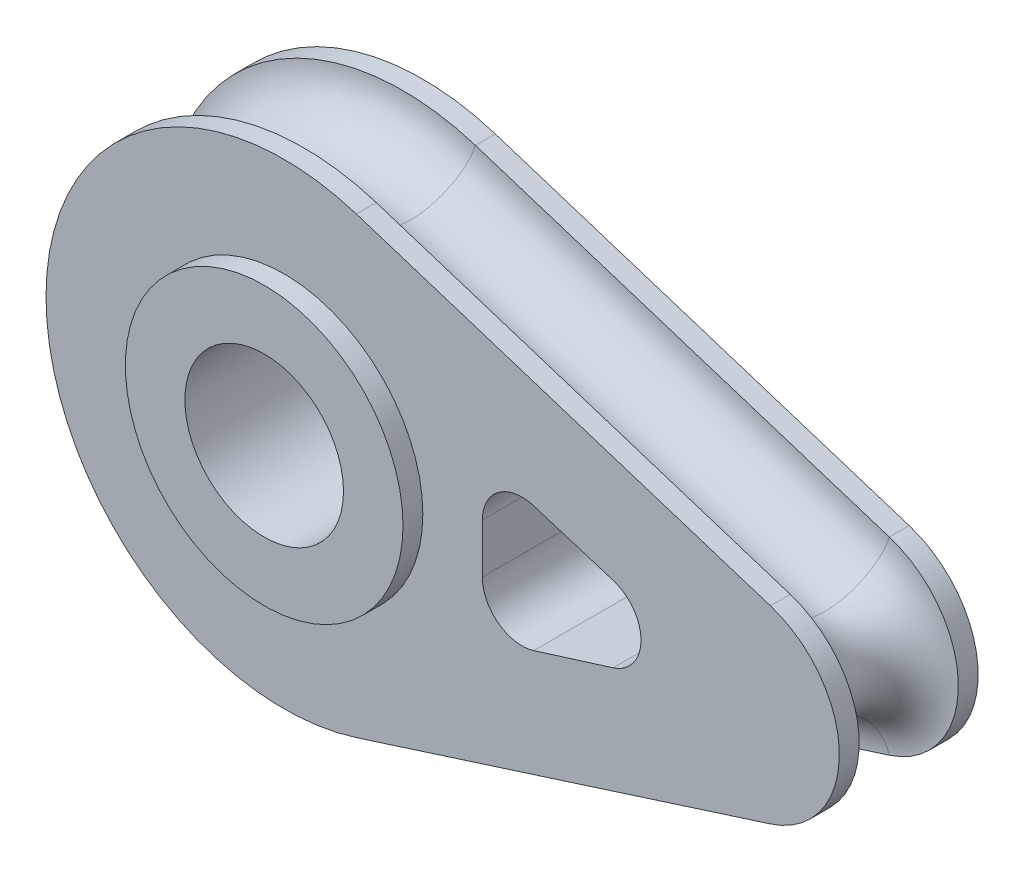
ISO-10303-21;
HEADER;
FILE_DESCRIPTION(('STEP AP214'),'2;1');
FILE_NAME('part.step','',(''),(''),'','','');
FILE_SCHEMA(('AUTOMOTIVE_DESIGN { 1 0 10303 214 1 1 1 1 }'));
ENDSEC;
DATA;
#1=APPLICATION_CONTEXT('core data for automotive mechanical design processes');
#2=APPLICATION_PROTOCOL_DEFINITION('international standard','automotive_design',2000,#1);
#3=PRODUCT_CONTEXT('',#1,'mechanical');
#4=PRODUCT('Part','Part','',(#3));
#5=PRODUCT_RELATED_PRODUCT_CATEGORY('part','',(#4));
#6=PRODUCT_DEFINITION_FORMATION('','',#4);
#7=PRODUCT_DEFINITION_CONTEXT('part definition',#1,'design');
#8=PRODUCT_DEFINITION('design','',#6,#7);
#9=PRODUCT_DEFINITION_SHAPE('','',#8);
#10=(LENGTH_UNIT() NAMED_UNIT(*) SI_UNIT(.MILLI.,.METRE.));
#11=(NAMED_UNIT(*) PLANE_ANGLE_UNIT() SI_UNIT($,.RADIAN.));
#12=(NAMED_UNIT(*) SI_UNIT($,.STERADIAN.) SOLID_ANGLE_UNIT());
#13=UNCERTAINTY_MEASURE_WITH_UNIT(LENGTH_MEASURE(1.E-05),#10,'distance_accuracy_value','');
#14=(GEOMETRIC_REPRESENTATION_CONTEXT(3) GLOBAL_UNCERTAINTY_ASSIGNED_CONTEXT((#13)) GLOBAL_UNIT_ASSIGNED_CONTEXT((#10,
#11,#12)) REPRESENTATION_CONTEXT('',''));
#15=CARTESIAN_POINT('',(0.,0.,0.));
#16=DIRECTION('',(0.,0.,1.));
#17=DIRECTION('',(1.,0.,0.));
#18=AXIS2_PLACEMENT_3D('',#15,#16,#17);
#19=CARTESIAN_POINT('',(-311.426086956522,-60.4876215679618,44.45));
#20=DIRECTION('',(0.,0.,-1.));
#21=DIRECTION('',(-1.,0.,0.));
#22=AXIS2_PLACEMENT_3D('',#19,#20,#21);
#23=CYLINDRICAL_SURFACE('',#22,152.4);
#24=CARTESIAN_POINT('',(-311.426086956522,-60.4876215679618,-31.75));
#25=DIRECTION('',(0.,0.,1.));
#26=DIRECTION('',(1.,0.,0.));
#27=AXIS2_PLACEMENT_3D('',#24,#25,#26);
#28=CIRCLE('',#27,152.4);
#29=CARTESIAN_POINT('',(-265.043478260869,84.6826701951464,-31.75));
#30=VERTEX_POINT('',#29);
#31=CARTESIAN_POINT('',(-265.043478260869,-205.65791333107,-31.75));
#32=VERTEX_POINT('',#31);
#33=EDGE_CURVE('E196',#30,#32,#28,.T.);
#34=ORIENTED_EDGE('',*,*,#33,.F.);
#35=DIRECTION('',(0.,0.,-1.));
#36=VECTOR('',#35,1.);
#37=CARTESIAN_POINT('',(-265.04347826087,84.6826701951466,44.45));
#38=LINE('',#37,#36);
#39=CARTESIAN_POINT('',(-265.04347826087,84.6826701951466,-44.45));
#40=VERTEX_POINT('',#39);
#41=EDGE_CURVE('E177',#30,#40,#38,.T.);
#42=ORIENTED_EDGE('',*,*,#41,.T.);
#43=CARTESIAN_POINT('',(-311.426086956522,-60.4876215679618,-44.45));
#44=DIRECTION('',(0.,0.,1.));
#45=DIRECTION('',(1.,0.,0.));
#46=AXIS2_PLACEMENT_3D('',#43,#44,#45);
#47=CIRCLE('',#46,152.4);
#48=CARTESIAN_POINT('',(-265.04347826087,-205.65791333107,-44.45));
#49=VERTEX_POINT('',#48);
#50=EDGE_CURVE('E222',#40,#49,#47,.T.);
#51=ORIENTED_EDGE('',*,*,#50,.T.);
#52=DIRECTION('',(0.,0.,-1.));
#53=VECTOR('',#52,1.);
#54=CARTESIAN_POINT('',(-265.04347826087,-205.65791333107,44.45));
#55=LINE('',#54,#53);
#56=EDGE_CURVE('E172',#32,#49,#55,.T.);
#57=ORIENTED_EDGE('',*,*,#56,.F.);
#58=EDGE_LOOP('',(#34,#42,#51,#57));
#59=FACE_BOUND('',#58,.T.);
#60=ADVANCED_FACE('F35',(#59),#23,.T.);
#61=CARTESIAN_POINT('',(-311.426086956522,-60.4876215679618,31.75));
#62=DIRECTION('',(0.,0.,-1.));
#63=DIRECTION('',(-1.,0.,0.));
#64=AXIS2_PLACEMENT_3D('',#61,#62,#63);
#65=CIRCLE('',#64,152.4);
#66=CARTESIAN_POINT('',(-265.043478260869,-205.65791333107,31.75));
#67=VERTEX_POINT('',#66);
#68=CARTESIAN_POINT('',(-265.04347826087,84.6826701951466,31.75));
#69=VERTEX_POINT('',#68);
#70=EDGE_CURVE('E194',#67,#69,#65,.T.);
#71=ORIENTED_EDGE('',*,*,#70,.F.);
#72=CARTESIAN_POINT('',(-265.04347826087,-205.65791333107,44.45));
#73=VERTEX_POINT('',#72);
#74=EDGE_CURVE('E173',#73,#67,#55,.T.);
#75=ORIENTED_EDGE('',*,*,#74,.F.);
#76=CARTESIAN_POINT('',(-311.426086956522,-60.4876215679618,44.45));
#77=DIRECTION('',(0.,0.,1.));
#78=DIRECTION('',(1.,0.,0.));
#79=AXIS2_PLACEMENT_3D('',#76,#77,#78);
#80=CIRCLE('',#79,152.4);
#81=CARTESIAN_POINT('',(-265.04347826087,84.6826701951466,44.45));
#82=VERTEX_POINT('',#81);
#83=EDGE_CURVE('E208',#82,#73,#80,.T.);
#84=ORIENTED_EDGE('',*,*,#83,.F.);
#85=EDGE_CURVE('E167',#82,#69,#38,.T.);
#86=ORIENTED_EDGE('',*,*,#85,.T.);
#87=EDGE_LOOP('',(#71,#75,#84,#86));
#88=FACE_BOUND('',#87,.T.);
#89=ADVANCED_FACE('F200',(#88),#23,.T.);
#90=CARTESIAN_POINT('',(-265.04347826087,-205.65791333107,44.45));
#91=DIRECTION('',(-0.304347826086957,0.952560969574202,0.));
#92=DIRECTION('',(-0.952560969574202,-0.304347826086957,0.));
#93=AXIS2_PLACEMENT_3D('',#90,#91,#92);
#94=PLANE('',#93);
#95=DIRECTION('',(-0.952560969574202,-0.304347826086957,0.));
#96=VECTOR('',#95,1.);
#97=CARTESIAN_POINT('',(1.34416378522093E-13,-120.975243135924,-31.75));
#98=LINE('',#97,#96);
#99=CARTESIAN_POINT('',(1.47910542273881E-13,-120.975243135924,-31.75));
#100=VERTEX_POINT('',#99);
#101=EDGE_CURVE('E11',#32,#100,#98,.F.);
#102=ORIENTED_EDGE('',*,*,#101,.F.);
#103=ORIENTED_EDGE('',*,*,#56,.T.);
#104=DIRECTION('',(0.952560969574202,0.304347826086957,0.));
#105=VECTOR('',#104,1.);
#106=CARTESIAN_POINT('',(-265.04347826087,-205.65791333107,-44.45));
#107=LINE('',#106,#105);
#108=CARTESIAN_POINT('',(0.,-120.975243135924,-44.45));
#109=VERTEX_POINT('',#108);
#110=EDGE_CURVE('E225',#49,#109,#107,.T.);
#111=ORIENTED_EDGE('',*,*,#110,.T.);
#112=DIRECTION('',(0.,0.,-1.));
#113=VECTOR('',#112,1.);
#114=CARTESIAN_POINT('',(0.,-120.975243135924,44.45));
#115=LINE('',#114,#113);
#116=EDGE_CURVE('E163',#100,#109,#115,.T.);
#117=ORIENTED_EDGE('',*,*,#116,.F.);
#118=EDGE_LOOP('',(#102,#103,#111,#117));
#119=FACE_BOUND('',#118,.T.);
#120=ADVANCED_FACE('F354',(#119),#94,.F.);
#121=DIRECTION('',(-0.952560969574202,-0.304347826086957,0.));
#122=VECTOR('',#121,1.);
#123=CARTESIAN_POINT('',(1.34416378522093E-13,-120.975243135924,31.75));
#124=LINE('',#123,#122);
#125=CARTESIAN_POINT('',(1.47910542273881E-13,-120.975243135924,31.75));
#126=VERTEX_POINT('',#125);
#127=EDGE_CURVE('E42',#126,#67,#124,.T.);
#128=ORIENTED_EDGE('',*,*,#127,.F.);
#129=CARTESIAN_POINT('',(0.,-120.975243135924,44.45));
#130=VERTEX_POINT('',#129);
#131=EDGE_CURVE('E159',#130,#126,#115,.T.);
#132=ORIENTED_EDGE('',*,*,#131,.F.);
#133=DIRECTION('',(0.952560969574202,0.304347826086957,0.));
#134=VECTOR('',#133,1.);
#135=CARTESIAN_POINT('',(-265.04347826087,-205.65791333107,44.45));
#136=LINE('',#135,#134);
#137=EDGE_CURVE('E204',#73,#130,#136,.T.);
#138=ORIENTED_EDGE('',*,*,#137,.F.);
#139=ORIENTED_EDGE('',*,*,#74,.T.);
#140=EDGE_LOOP('',(#128,#132,#138,#139));
#141=FACE_BOUND('',#140,.T.);
#142=ADVANCED_FACE('F203',(#141),#94,.F.);
#143=CARTESIAN_POINT('',(-19.3260869565217,-60.4876215679618,44.45));
#144=DIRECTION('',(0.,0.,-1.));
#145=DIRECTION('',(-1.,0.,0.));
#146=AXIS2_PLACEMENT_3D('',#143,#144,#145);
#147=CYLINDRICAL_SURFACE('',#146,63.5);
#148=CARTESIAN_POINT('',(-19.3260869565217,-60.4876215679618,-31.75));
#149=DIRECTION('',(0.,0.,1.));
#150=DIRECTION('',(1.,0.,0.));
#151=AXIS2_PLACEMENT_3D('',#148,#149,#150);
#152=CIRCLE('',#151,63.5);
#153=CARTESIAN_POINT('',(0.,0.,-31.75));
#154=VERTEX_POINT('',#153);
#155=EDGE_CURVE('E147',#100,#154,#152,.T.);
#156=ORIENTED_EDGE('',*,*,#155,.F.);
#157=ORIENTED_EDGE('',*,*,#116,.T.);
#158=CARTESIAN_POINT('',(-19.3260869565217,-60.4876215679618,-44.45));
#159=DIRECTION('',(0.,0.,1.));
#160=DIRECTION('',(1.,0.,0.));
#161=AXIS2_PLACEMENT_3D('',#158,#159,#160);
#162=CIRCLE('',#161,63.5);
#163=CARTESIAN_POINT('',(0.,0.,-44.45));
#164=VERTEX_POINT('',#163);
#165=EDGE_CURVE('E215',#109,#164,#162,.T.);
#166=ORIENTED_EDGE('',*,*,#165,.T.);
#167=DIRECTION('',(0.,0.,-1.));
#168=VECTOR('',#167,1.);
#169=CARTESIAN_POINT('',(0.,0.,44.45));
#170=LINE('',#169,#168);
#171=EDGE_CURVE('E164',#154,#164,#170,.T.);
#172=ORIENTED_EDGE('',*,*,#171,.F.);
#173=EDGE_LOOP('',(#156,#157,#166,#172));
#174=FACE_BOUND('',#173,.T.);
#175=ADVANCED_FACE('F233',(#174),#147,.T.);
#176=CARTESIAN_POINT('',(-19.3260869565217,-60.4876215679618,31.75));
#177=DIRECTION('',(0.,0.,-1.));
#178=DIRECTION('',(-1.,0.,0.));
#179=AXIS2_PLACEMENT_3D('',#176,#177,#178);
#180=CIRCLE('',#179,63.5);
#181=CARTESIAN_POINT('',(-1.44811698864151E-13,0.,31.75));
#182=VERTEX_POINT('',#181);
#183=EDGE_CURVE('E144',#182,#126,#180,.T.);
#184=ORIENTED_EDGE('',*,*,#183,.F.);
#185=CARTESIAN_POINT('',(0.,0.,44.45));
#186=VERTEX_POINT('',#185);
#187=EDGE_CURVE('E156',#186,#182,#170,.T.);
#188=ORIENTED_EDGE('',*,*,#187,.F.);
#189=CARTESIAN_POINT('',(-19.3260869565217,-60.4876215679618,44.45));
#190=DIRECTION('',(0.,0.,1.));
#191=DIRECTION('',(1.,0.,0.));
#192=AXIS2_PLACEMENT_3D('',#189,#190,#191);
#193=CIRCLE('',#192,63.5);
#194=EDGE_CURVE('E207',#130,#186,#193,.T.);
#195=ORIENTED_EDGE('',*,*,#194,.F.);
#196=ORIENTED_EDGE('',*,*,#131,.T.);
#197=EDGE_LOOP('',(#184,#188,#195,#196));
#198=FACE_BOUND('',#197,.T.);
#199=ADVANCED_FACE('F154',(#198),#147,.T.);
#200=CARTESIAN_POINT('',(-265.04347826087,84.6826701951466,44.45));
#201=DIRECTION('',(-0.304347826086957,-0.952560969574202,0.));
#202=DIRECTION('',(0.952560969574202,-0.304347826086957,0.));
#203=AXIS2_PLACEMENT_3D('',#200,#201,#202);
#204=PLANE('',#203);
#205=ORIENTED_EDGE('',*,*,#187,.T.);
#206=DIRECTION('',(-0.952560969574202,0.304347826086957,0.));
#207=VECTOR('',#206,1.);
#208=CARTESIAN_POINT('',(-1.44811698864151E-13,0.,31.75));
#209=LINE('',#208,#207);
#210=EDGE_CURVE('E132',#182,#69,#209,.T.);
#211=ORIENTED_EDGE('',*,*,#210,.T.);
#212=ORIENTED_EDGE('',*,*,#85,.F.);
#213=DIRECTION('',(-0.952560969574202,0.304347826086957,0.));
#214=VECTOR('',#213,1.);
#215=CARTESIAN_POINT('',(-265.04347826087,84.6826701951466,44.45));
#216=LINE('',#215,#214);
#217=EDGE_CURVE('E162',#186,#82,#216,.T.);
#218=ORIENTED_EDGE('',*,*,#217,.F.);
#219=EDGE_LOOP('',(#205,#211,#212,#218));
#220=FACE_BOUND('',#219,.T.);
#221=ADVANCED_FACE('F161',(#220),#204,.F.);
#222=CARTESIAN_POINT('',(-311.426086956522,-60.4876215679618,44.45));
#223=DIRECTION('',(0.,0.,1.));
#224=DIRECTION('',(1.,0.,0.));
#225=AXIS2_PLACEMENT_3D('',#222,#223,#224);
#226=PLANE('',#225);
#227=ORIENTED_EDGE('',*,*,#83,.T.);
#228=ORIENTED_EDGE('',*,*,#137,.T.);
#229=ORIENTED_EDGE('',*,*,#194,.T.);
#230=ORIENTED_EDGE('',*,*,#217,.T.);
#231=EDGE_LOOP('',(#227,#228,#229,#230));
#232=FACE_BOUND('',#231,.T.);
#233=DIRECTION('',(0.95447997803503,0.298274993135947,0.));
#234=VECTOR('',#233,1.);
#235=CARTESIAN_POINT('',(-151.449902130869,-100.606413010052,44.45));
#236=LINE('',#235,#234);
#237=CARTESIAN_POINT('',(-151.449902130869,-100.606413010052,44.45));
#238=VERTEX_POINT('',#237);
#239=CARTESIAN_POINT('',(-100.649902130869,-84.7314130100516,44.45));
#240=VERTEX_POINT('',#239);
#241=EDGE_CURVE('E275',#238,#240,#236,.T.);
#242=ORIENTED_EDGE('',*,*,#241,.F.);
#243=CARTESIAN_POINT('',(-159.026086956522,-76.3626215679618,44.45));
#244=DIRECTION('',(0.,0.,1.));
#245=DIRECTION('',(1.,0.,0.));
#246=AXIS2_PLACEMENT_3D('',#243,#244,#245);
#247=CIRCLE('',#246,25.4);
#248=CARTESIAN_POINT('',(-184.426086956522,-76.3626215679618,44.45));
#249=VERTEX_POINT('',#248);
#250=EDGE_CURVE('E273',#249,#238,#247,.T.);
#251=ORIENTED_EDGE('',*,*,#250,.F.);
#252=DIRECTION('',(0.,-1.,0.));
#253=VECTOR('',#252,1.);
#254=CARTESIAN_POINT('',(-184.426086956522,-44.6126215679619,44.45));
#255=LINE('',#254,#253);
#256=CARTESIAN_POINT('',(-184.426086956522,-44.6126215679619,44.45));
#257=VERTEX_POINT('',#256);
#258=EDGE_CURVE('E285',#257,#249,#255,.T.);
#259=ORIENTED_EDGE('',*,*,#258,.F.);
#260=CARTESIAN_POINT('',(-159.026086956522,-44.6126215679618,44.45));
#261=DIRECTION('',(0.,0.,1.));
#262=DIRECTION('',(1.,0.,0.));
#263=AXIS2_PLACEMENT_3D('',#260,#261,#262);
#264=CIRCLE('',#263,25.4);
#265=CARTESIAN_POINT('',(-151.449902130869,-20.3688301258721,44.45));
#266=VERTEX_POINT('',#265);
#267=EDGE_CURVE('E282',#266,#257,#264,.T.);
#268=ORIENTED_EDGE('',*,*,#267,.F.);
#269=DIRECTION('',(-0.95447997803503,0.298274993135946,0.));
#270=VECTOR('',#269,1.);
#271=CARTESIAN_POINT('',(-151.449902130869,-20.3688301258721,44.45));
#272=LINE('',#271,#270);
#273=CARTESIAN_POINT('',(-100.649902130869,-36.2438301258721,44.45));
#274=VERTEX_POINT('',#273);
#275=EDGE_CURVE('E280',#274,#266,#272,.T.);
#276=ORIENTED_EDGE('',*,*,#275,.F.);
#277=CARTESIAN_POINT('',(-108.226086956522,-60.4876215679618,44.45));
#278=DIRECTION('',(0.,0.,1.));
#279=DIRECTION('',(1.,0.,0.));
#280=AXIS2_PLACEMENT_3D('',#277,#278,#279);
#281=CIRCLE('',#280,25.4);
#282=EDGE_CURVE('E278',#240,#274,#281,.T.);
#283=ORIENTED_EDGE('',*,*,#282,.F.);
#284=EDGE_LOOP('',(#242,#251,#259,#268,#276,#283));
#285=FACE_BOUND('',#284,.T.);
#286=CARTESIAN_POINT('',(-311.426086956522,-60.4876215679618,44.45));
#287=DIRECTION('',(0.,0.,1.));
#288=DIRECTION('',(1.,0.,0.));
#289=AXIS2_PLACEMENT_3D('',#286,#287,#288);
#290=CIRCLE('',#289,88.9);
#291=CARTESIAN_POINT('',(-222.526086956522,-60.4876215679618,44.45));
#292=VERTEX_POINT('',#291);
#293=EDGE_CURVE('E266',#292,#292,#290,.T.);
#294=ORIENTED_EDGE('',*,*,#293,.F.);
#295=EDGE_LOOP('',(#294));
#296=FACE_BOUND('',#295,.T.);
#297=ADVANCED_FACE('F210',(#232,#285,#296),#226,.T.);
#298=CARTESIAN_POINT('',(-311.426086956522,-60.4876215679618,-44.45));
#299=DIRECTION('',(0.,0.,1.));
#300=DIRECTION('',(1.,0.,0.));
#301=AXIS2_PLACEMENT_3D('',#298,#299,#300);
#302=PLANE('',#301);
#303=CARTESIAN_POINT('',(-311.426086956522,-60.4876215679618,-44.45));
#304=DIRECTION('',(0.,0.,1.));
#305=DIRECTION('',(1.,0.,0.));
#306=AXIS2_PLACEMENT_3D('',#303,#304,#305);
#307=CIRCLE('',#306,88.9);
#308=CARTESIAN_POINT('',(-222.526086956522,-60.4876215679618,-44.45));
#309=VERTEX_POINT('',#308);
#310=EDGE_CURVE('E251',#309,#309,#307,.T.);
#311=ORIENTED_EDGE('',*,*,#310,.T.);
#312=EDGE_LOOP('',(#311));
#313=FACE_BOUND('',#312,.T.);
#314=ORIENTED_EDGE('',*,*,#50,.F.);
#315=DIRECTION('',(-0.952560969574202,0.304347826086957,0.));
#316=VECTOR('',#315,1.);
#317=CARTESIAN_POINT('',(-265.04347826087,84.6826701951466,-44.45));
#318=LINE('',#317,#316);
#319=EDGE_CURVE('E212',#164,#40,#318,.T.);
#320=ORIENTED_EDGE('',*,*,#319,.F.);
#321=ORIENTED_EDGE('',*,*,#165,.F.);
#322=ORIENTED_EDGE('',*,*,#110,.F.);
#323=EDGE_LOOP('',(#314,#320,#321,#322));
#324=FACE_BOUND('',#323,.T.);
#325=CARTESIAN_POINT('',(-159.026086956522,-76.3626215679618,-44.45));
#326=DIRECTION('',(0.,0.,1.));
#327=DIRECTION('',(1.,0.,0.));
#328=AXIS2_PLACEMENT_3D('',#325,#326,#327);
#329=CIRCLE('',#328,25.4);
#330=CARTESIAN_POINT('',(-184.426086956522,-76.3626215679618,-44.45));
#331=VERTEX_POINT('',#330);
#332=CARTESIAN_POINT('',(-151.449902130869,-100.606413010052,-44.45));
#333=VERTEX_POINT('',#332);
#334=EDGE_CURVE('E270',#331,#333,#329,.T.);
#335=ORIENTED_EDGE('',*,*,#334,.T.);
#336=DIRECTION('',(0.95447997803503,0.298274993135947,0.));
#337=VECTOR('',#336,1.);
#338=CARTESIAN_POINT('',(-151.449902130869,-100.606413010052,-44.45));
#339=LINE('',#338,#337);
#340=CARTESIAN_POINT('',(-100.649902130869,-84.7314130100516,-44.45));
#341=VERTEX_POINT('',#340);
#342=EDGE_CURVE('E290',#333,#341,#339,.T.);
#343=ORIENTED_EDGE('',*,*,#342,.T.);
#344=CARTESIAN_POINT('',(-108.226086956522,-60.4876215679618,-44.45));
#345=DIRECTION('',(0.,0.,1.));
#346=DIRECTION('',(1.,0.,0.));
#347=AXIS2_PLACEMENT_3D('',#344,#345,#346);
#348=CIRCLE('',#347,25.4);
#349=CARTESIAN_POINT('',(-100.649902130869,-36.2438301258721,-44.45));
#350=VERTEX_POINT('',#349);
#351=EDGE_CURVE('E293',#341,#350,#348,.T.);
#352=ORIENTED_EDGE('',*,*,#351,.T.);
#353=DIRECTION('',(-0.95447997803503,0.298274993135946,0.));
#354=VECTOR('',#353,1.);
#355=CARTESIAN_POINT('',(-151.449902130869,-20.3688301258721,-44.45));
#356=LINE('',#355,#354);
#357=CARTESIAN_POINT('',(-151.449902130869,-20.3688301258721,-44.45));
#358=VERTEX_POINT('',#357);
#359=EDGE_CURVE('E296',#350,#358,#356,.T.);
#360=ORIENTED_EDGE('',*,*,#359,.T.);
#361=CARTESIAN_POINT('',(-159.026086956522,-44.6126215679618,-44.45));
#362=DIRECTION('',(0.,0.,1.));
#363=DIRECTION('',(1.,0.,0.));
#364=AXIS2_PLACEMENT_3D('',#361,#362,#363);
#365=CIRCLE('',#364,25.4);
#366=CARTESIAN_POINT('',(-184.426086956522,-44.6126215679619,-44.45));
#367=VERTEX_POINT('',#366);
#368=EDGE_CURVE('E299',#358,#367,#365,.T.);
#369=ORIENTED_EDGE('',*,*,#368,.T.);
#370=DIRECTION('',(0.,-1.,0.));
#371=VECTOR('',#370,1.);
#372=CARTESIAN_POINT('',(-184.426086956522,-44.6126215679619,-44.45));
#373=LINE('',#372,#371);
#374=EDGE_CURVE('E276',#367,#331,#373,.T.);
#375=ORIENTED_EDGE('',*,*,#374,.T.);
#376=EDGE_LOOP('',(#335,#343,#352,#360,#369,#375));
#377=FACE_BOUND('',#376,.T.);
#378=ADVANCED_FACE('F238',(#313,#324,#377),#302,.F.);
#379=ORIENTED_EDGE('',*,*,#41,.F.);
#380=DIRECTION('',(-0.952560969574202,0.304347826086957,0.));
#381=VECTOR('',#380,1.);
#382=CARTESIAN_POINT('',(-1.44811698864151E-13,0.,-31.75));
#383=LINE('',#382,#381);
#384=EDGE_CURVE('E138',#30,#154,#383,.F.);
#385=ORIENTED_EDGE('',*,*,#384,.T.);
#386=ORIENTED_EDGE('',*,*,#171,.T.);
#387=ORIENTED_EDGE('',*,*,#319,.T.);
#388=EDGE_LOOP('',(#379,#385,#386,#387));
#389=FACE_BOUND('',#388,.T.);
#390=ADVANCED_FACE('F242',(#389),#204,.F.);
#391=CARTESIAN_POINT('',(-159.026086956522,-76.3626215679618,44.45));
#392=DIRECTION('',(0.,0.,-1.));
#393=DIRECTION('',(-1.,0.,0.));
#394=AXIS2_PLACEMENT_3D('',#391,#392,#393);
#395=CYLINDRICAL_SURFACE('',#394,25.4);
#396=ORIENTED_EDGE('',*,*,#334,.F.);
#397=DIRECTION('',(0.,0.,-1.));
#398=VECTOR('',#397,1.);
#399=CARTESIAN_POINT('',(-184.426086956522,-76.3626215679618,44.45));
#400=LINE('',#399,#398);
#401=EDGE_CURVE('E287',#249,#331,#400,.T.);
#402=ORIENTED_EDGE('',*,*,#401,.F.);
#403=ORIENTED_EDGE('',*,*,#250,.T.);
#404=DIRECTION('',(0.,0.,-1.));
#405=VECTOR('',#404,1.);
#406=CARTESIAN_POINT('',(-151.449902130869,-100.606413010052,44.45));
#407=LINE('',#406,#405);
#408=EDGE_CURVE('E217',#238,#333,#407,.T.);
#409=ORIENTED_EDGE('',*,*,#408,.T.);
#410=EDGE_LOOP('',(#396,#402,#403,#409));
#411=FACE_BOUND('',#410,.T.);
#412=ADVANCED_FACE('F318',(#411),#395,.F.);
#413=CARTESIAN_POINT('',(-151.449902130869,-100.606413010052,44.45));
#414=DIRECTION('',(-0.298274993135947,0.95447997803503,0.));
#415=DIRECTION('',(-0.95447997803503,-0.298274993135947,0.));
#416=AXIS2_PLACEMENT_3D('',#413,#414,#415);
#417=PLANE('',#416);
#418=ORIENTED_EDGE('',*,*,#342,.F.);
#419=ORIENTED_EDGE('',*,*,#408,.F.);
#420=ORIENTED_EDGE('',*,*,#241,.T.);
#421=DIRECTION('',(0.,0.,-1.));
#422=VECTOR('',#421,1.);
#423=CARTESIAN_POINT('',(-100.649902130869,-84.7314130100516,44.45));
#424=LINE('',#423,#422);
#425=EDGE_CURVE('E311',#240,#341,#424,.T.);
#426=ORIENTED_EDGE('',*,*,#425,.T.);
#427=EDGE_LOOP('',(#418,#419,#420,#426));
#428=FACE_BOUND('',#427,.T.);
#429=ADVANCED_FACE('F331',(#428),#417,.T.);
#430=CARTESIAN_POINT('',(-108.226086956522,-60.4876215679618,44.45));
#431=DIRECTION('',(0.,0.,-1.));
#432=DIRECTION('',(-1.,0.,0.));
#433=AXIS2_PLACEMENT_3D('',#430,#431,#432);
#434=CYLINDRICAL_SURFACE('',#433,25.4);
#435=ORIENTED_EDGE('',*,*,#351,.F.);
#436=ORIENTED_EDGE('',*,*,#425,.F.);
#437=ORIENTED_EDGE('',*,*,#282,.T.);
#438=DIRECTION('',(0.,0.,-1.));
#439=VECTOR('',#438,1.);
#440=CARTESIAN_POINT('',(-100.649902130869,-36.2438301258721,44.45));
#441=LINE('',#440,#439);
#442=EDGE_CURVE('E310',#274,#350,#441,.T.);
#443=ORIENTED_EDGE('',*,*,#442,.T.);
#444=EDGE_LOOP('',(#435,#436,#437,#443));
#445=FACE_BOUND('',#444,.T.);
#446=ADVANCED_FACE('F333',(#445),#434,.F.);
#447=CARTESIAN_POINT('',(-151.449902130869,-20.3688301258721,44.45));
#448=DIRECTION('',(-0.298274993135946,-0.95447997803503,0.));
#449=DIRECTION('',(0.95447997803503,-0.298274993135946,0.));
#450=AXIS2_PLACEMENT_3D('',#447,#448,#449);
#451=PLANE('',#450);
#452=ORIENTED_EDGE('',*,*,#359,.F.);
#453=ORIENTED_EDGE('',*,*,#442,.F.);
#454=ORIENTED_EDGE('',*,*,#275,.T.);
#455=DIRECTION('',(0.,0.,-1.));
#456=VECTOR('',#455,1.);
#457=CARTESIAN_POINT('',(-151.449902130869,-20.3688301258721,44.45));
#458=LINE('',#457,#456);
#459=EDGE_CURVE('E308',#266,#358,#458,.T.);
#460=ORIENTED_EDGE('',*,*,#459,.T.);
#461=EDGE_LOOP('',(#452,#453,#454,#460));
#462=FACE_BOUND('',#461,.T.);
#463=ADVANCED_FACE('F337',(#462),#451,.T.);
#464=CARTESIAN_POINT('',(-159.026086956522,-44.6126215679618,44.45));
#465=DIRECTION('',(0.,0.,-1.));
#466=DIRECTION('',(-1.,0.,0.));
#467=AXIS2_PLACEMENT_3D('',#464,#465,#466);
#468=CYLINDRICAL_SURFACE('',#467,25.4);
#469=ORIENTED_EDGE('',*,*,#368,.F.);
#470=ORIENTED_EDGE('',*,*,#459,.F.);
#471=ORIENTED_EDGE('',*,*,#267,.T.);
#472=DIRECTION('',(0.,0.,-1.));
#473=VECTOR('',#472,1.);
#474=CARTESIAN_POINT('',(-184.426086956522,-44.6126215679619,44.45));
#475=LINE('',#474,#473);
#476=EDGE_CURVE('E306',#257,#367,#475,.T.);
#477=ORIENTED_EDGE('',*,*,#476,.T.);
#478=EDGE_LOOP('',(#469,#470,#471,#477));
#479=FACE_BOUND('',#478,.T.);
#480=ADVANCED_FACE('F340',(#479),#468,.F.);
#481=CARTESIAN_POINT('',(-184.426086956522,-44.6126215679619,44.45));
#482=DIRECTION('',(1.,0.,0.));
#483=DIRECTION('',(0.,1.,0.));
#484=AXIS2_PLACEMENT_3D('',#481,#482,#483);
#485=PLANE('',#484);
#486=ORIENTED_EDGE('',*,*,#374,.F.);
#487=ORIENTED_EDGE('',*,*,#476,.F.);
#488=ORIENTED_EDGE('',*,*,#258,.T.);
#489=ORIENTED_EDGE('',*,*,#401,.T.);
#490=EDGE_LOOP('',(#486,#487,#488,#489));
#491=FACE_BOUND('',#490,.T.);
#492=ADVANCED_FACE('F325',(#491),#485,.T.);
#493=CARTESIAN_POINT('',(-311.426086956522,-60.4876215679618,44.45));
#494=DIRECTION('',(0.,0.,-1.));
#495=DIRECTION('',(-1.,0.,0.));
#496=AXIS2_PLACEMENT_3D('',#493,#494,#495);
#497=CYLINDRICAL_SURFACE('',#496,50.8);
#498=CARTESIAN_POINT('',(-311.426086956522,-60.4876215679618,57.15));
#499=DIRECTION('',(0.,0.,1.));
#500=DIRECTION('',(1.,0.,0.));
#501=AXIS2_PLACEMENT_3D('',#498,#499,#500);
#502=CIRCLE('',#501,50.8);
#503=CARTESIAN_POINT('',(-260.626086956522,-60.4876215679618,57.15));
#504=VERTEX_POINT('',#503);
#505=EDGE_CURVE('E261',#504,#504,#502,.T.);
#506=ORIENTED_EDGE('',*,*,#505,.T.);
#507=EDGE_LOOP('',(#506));
#508=FACE_BOUND('',#507,.T.);
#509=CARTESIAN_POINT('',(-311.426086956522,-60.4876215679618,-57.15));
#510=DIRECTION('',(0.,0.,1.));
#511=DIRECTION('',(1.,0.,0.));
#512=AXIS2_PLACEMENT_3D('',#509,#510,#511);
#513=CIRCLE('',#512,50.8);
#514=CARTESIAN_POINT('',(-260.626086956522,-60.4876215679618,-57.15));
#515=VERTEX_POINT('',#514);
#516=EDGE_CURVE('E248',#515,#515,#513,.T.);
#517=ORIENTED_EDGE('',*,*,#516,.F.);
#518=EDGE_LOOP('',(#517));
#519=FACE_BOUND('',#518,.T.);
#520=ADVANCED_FACE('F347',(#508,#519),#497,.F.);
#521=CARTESIAN_POINT('',(-311.426086956522,-60.4876215679618,57.15));
#522=DIRECTION('',(0.,0.,1.));
#523=DIRECTION('',(1.,0.,0.));
#524=AXIS2_PLACEMENT_3D('',#521,#522,#523);
#525=PLANE('',#524);
#526=CARTESIAN_POINT('',(-311.426086956522,-60.4876215679618,57.15));
#527=DIRECTION('',(0.,0.,1.));
#528=DIRECTION('',(1.,0.,0.));
#529=AXIS2_PLACEMENT_3D('',#526,#527,#528);
#530=CIRCLE('',#529,88.9);
#531=CARTESIAN_POINT('',(-222.526086956522,-60.4876215679618,57.15));
#532=VERTEX_POINT('',#531);
#533=EDGE_CURVE('E267',#532,#532,#530,.T.);
#534=ORIENTED_EDGE('',*,*,#533,.T.);
#535=EDGE_LOOP('',(#534));
#536=FACE_BOUND('',#535,.T.);
#537=ORIENTED_EDGE('',*,*,#505,.F.);
#538=EDGE_LOOP('',(#537));
#539=FACE_BOUND('',#538,.T.);
#540=ADVANCED_FACE('F410',(#536,#539),#525,.T.);
#541=CARTESIAN_POINT('',(-311.426086956522,-60.4876215679618,57.15));
#542=DIRECTION('',(0.,0.,-1.));
#543=DIRECTION('',(-1.,0.,0.));
#544=AXIS2_PLACEMENT_3D('',#541,#542,#543);
#545=CYLINDRICAL_SURFACE('',#544,88.9);
#546=ORIENTED_EDGE('',*,*,#533,.F.);
#547=EDGE_LOOP('',(#546));
#548=FACE_BOUND('',#547,.T.);
#549=ORIENTED_EDGE('',*,*,#293,.T.);
#550=EDGE_LOOP('',(#549));
#551=FACE_BOUND('',#550,.T.);
#552=ADVANCED_FACE('F415',(#548,#551),#545,.T.);
#553=CARTESIAN_POINT('',(-311.426086956522,-60.4876215679618,-57.15));
#554=DIRECTION('',(0.,0.,1.));
#555=DIRECTION('',(1.,0.,0.));
#556=AXIS2_PLACEMENT_3D('',#553,#554,#555);
#557=CYLINDRICAL_SURFACE('',#556,88.9);
#558=CARTESIAN_POINT('',(-311.426086956522,-60.4876215679618,-57.15));
#559=DIRECTION('',(0.,0.,1.));
#560=DIRECTION('',(1.,0.,0.));
#561=AXIS2_PLACEMENT_3D('',#558,#559,#560);
#562=CIRCLE('',#561,88.9);
#563=CARTESIAN_POINT('',(-222.526086956522,-60.4876215679618,-57.15));
#564=VERTEX_POINT('',#563);
#565=EDGE_CURVE('E258',#564,#564,#562,.T.);
#566=ORIENTED_EDGE('',*,*,#565,.T.);
#567=EDGE_LOOP('',(#566));
#568=FACE_BOUND('',#567,.T.);
#569=ORIENTED_EDGE('',*,*,#310,.F.);
#570=EDGE_LOOP('',(#569));
#571=FACE_BOUND('',#570,.T.);
#572=ADVANCED_FACE('F425',(#568,#571),#557,.T.);
#573=CARTESIAN_POINT('',(-311.426086956522,-60.4876215679618,-57.15));
#574=DIRECTION('',(0.,0.,-1.));
#575=DIRECTION('',(1.,0.,0.));
#576=AXIS2_PLACEMENT_3D('',#573,#574,#575);
#577=PLANE('',#576);
#578=ORIENTED_EDGE('',*,*,#516,.T.);
#579=EDGE_LOOP('',(#578));
#580=FACE_BOUND('',#579,.T.);
#581=ORIENTED_EDGE('',*,*,#565,.F.);
#582=EDGE_LOOP('',(#581));
#583=FACE_BOUND('',#582,.T.);
#584=ADVANCED_FACE('F450',(#580,#583),#577,.T.);
#585=CARTESIAN_POINT('',(1.63982100373524E-13,-120.975243135924,0.));
#586=DIRECTION('',(-0.952560969574202,-0.304347826086957,0.));
#587=DIRECTION('',(0.304347826086957,-0.952560969574202,0.));
#588=AXIS2_PLACEMENT_3D('',#585,#586,#587);
#589=CYLINDRICAL_SURFACE('',#588,31.75);
#590=ORIENTED_EDGE('',*,*,#101,.T.);
#591=CARTESIAN_POINT('',(1.63982100373524E-13,-120.975243135924,0.));
#592=DIRECTION('',(0.952560969574202,0.304347826086956,0.));
#593=DIRECTION('',(-0.304347826086956,0.952560969574202,0.));
#594=AXIS2_PLACEMENT_3D('',#591,#592,#593);
#595=CIRCLE('',#594,31.75);
#596=EDGE_CURVE('E149',#100,#126,#595,.T.);
#597=ORIENTED_EDGE('',*,*,#596,.T.);
#598=ORIENTED_EDGE('',*,*,#127,.T.);
#599=CARTESIAN_POINT('',(-265.043478260869,-205.65791333107,0.));
#600=DIRECTION('',(0.952560969574202,0.304347826086956,0.));
#601=DIRECTION('',(-0.304347826086956,0.952560969574202,0.));
#602=AXIS2_PLACEMENT_3D('',#599,#600,#601);
#603=CIRCLE('',#602,31.75);
#604=EDGE_CURVE('E188',#32,#67,#603,.T.);
#605=ORIENTED_EDGE('',*,*,#604,.F.);
#606=EDGE_LOOP('',(#590,#597,#598,#605));
#607=FACE_BOUND('',#606,.T.);
#608=ADVANCED_FACE('F187',(#607),#589,.F.);
#609=CARTESIAN_POINT('',(-311.426086956522,-60.4876215679618,0.));
#610=DIRECTION('',(0.,0.,-1.));
#611=DIRECTION('',(-1.,0.,0.));
#612=AXIS2_PLACEMENT_3D('',#609,#610,#611);
#613=TOROIDAL_SURFACE('',#612,152.4,31.75);
#614=ORIENTED_EDGE('',*,*,#33,.T.);
#615=ORIENTED_EDGE('',*,*,#604,.T.);
#616=ORIENTED_EDGE('',*,*,#70,.T.);
#617=CARTESIAN_POINT('',(-265.04347826087,84.6826701951467,0.));
#618=DIRECTION('',(-0.952560969574202,0.304347826086957,0.));
#619=DIRECTION('',(0.,0.,-1.));
#620=AXIS2_PLACEMENT_3D('',#617,#618,#619);
#621=CIRCLE('',#620,31.75);
#622=EDGE_CURVE('E54',#30,#69,#621,.T.);
#623=ORIENTED_EDGE('',*,*,#622,.F.);
#624=EDGE_LOOP('',(#614,#615,#616,#623));
#625=FACE_BOUND('',#624,.T.);
#626=ADVANCED_FACE('F193',(#625),#613,.F.);
#627=CARTESIAN_POINT('',(-19.3260869565217,-60.4876215679618,0.));
#628=DIRECTION('',(0.,0.,-1.));
#629=DIRECTION('',(-1.,0.,0.));
#630=AXIS2_PLACEMENT_3D('',#627,#628,#629);
#631=TOROIDAL_SURFACE('',#630,63.5000000000001,31.75);
#632=ORIENTED_EDGE('',*,*,#155,.T.);
#633=CARTESIAN_POINT('',(-1.11022302462516E-13,1.38777878078145E-13,0.));
#634=DIRECTION('',(-0.952560969574202,0.304347826086957,0.));
#635=DIRECTION('',(-0.304347826086957,-0.952560969574202,0.));
#636=AXIS2_PLACEMENT_3D('',#633,#634,#635);
#637=CIRCLE('',#636,31.75);
#638=EDGE_CURVE('E49',#154,#182,#637,.T.);
#639=ORIENTED_EDGE('',*,*,#638,.T.);
#640=ORIENTED_EDGE('',*,*,#183,.T.);
#641=ORIENTED_EDGE('',*,*,#596,.F.);
#642=EDGE_LOOP('',(#632,#639,#640,#641));
#643=FACE_BOUND('',#642,.T.);
#644=ADVANCED_FACE('F142',(#643),#631,.F.);
#645=CARTESIAN_POINT('',(-1.11022302462516E-13,1.38777878078145E-13,0.));
#646=DIRECTION('',(-0.952560969574202,0.304347826086957,0.));
#647=DIRECTION('',(-0.304347826086957,-0.952560969574202,0.));
#648=AXIS2_PLACEMENT_3D('',#645,#646,#647);
#649=CYLINDRICAL_SURFACE('',#648,31.75);
#650=ORIENTED_EDGE('',*,*,#638,.F.);
#651=ORIENTED_EDGE('',*,*,#384,.F.);
#652=ORIENTED_EDGE('',*,*,#622,.T.);
#653=ORIENTED_EDGE('',*,*,#210,.F.);
#654=EDGE_LOOP('',(#650,#651,#652,#653));
#655=FACE_BOUND('',#654,.T.);
#656=ADVANCED_FACE('F133',(#655),#649,.F.);
#657=CLOSED_SHELL('',(#60,#89,#120,#142,#175,#199,#221,#297,#378,#390,#412,#429,#446,#463,#480,
#492,#520,#540,#552,#572,#584,#608,#626,#644,#656));
#658=MANIFOLD_SOLID_BREP('B2',#657);
#659=ADVANCED_BREP_SHAPE_REPRESENTATION('',(#18,#658),#14);
#660=SHAPE_DEFINITION_REPRESENTATION(#9,#659);
ENDSEC;
END-ISO-10303-21;
